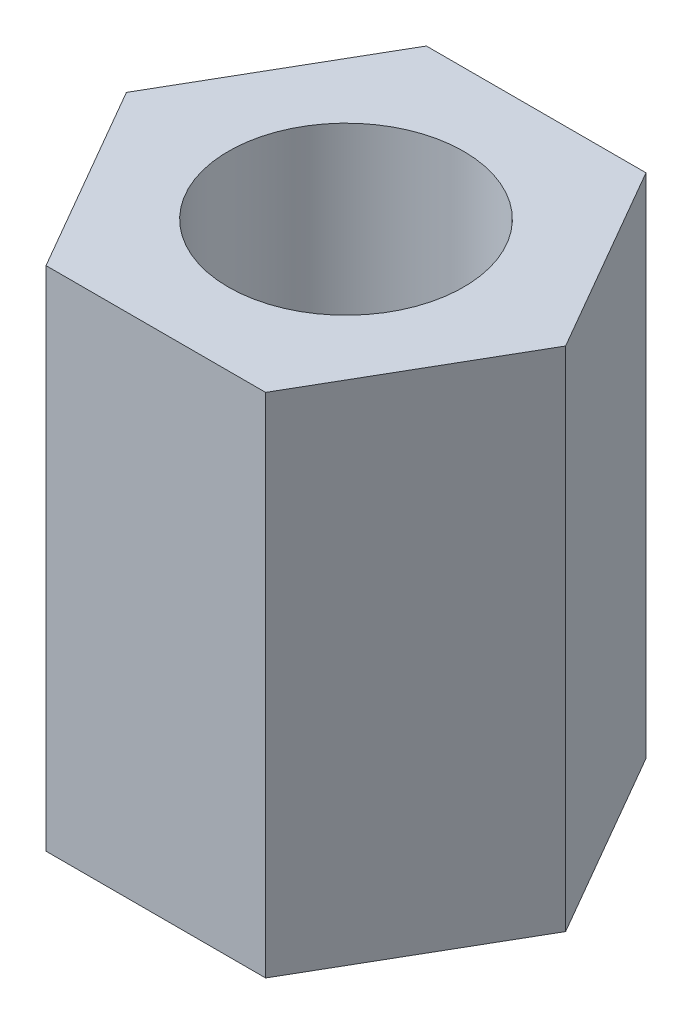
ISO-10303-21;
HEADER;
FILE_DESCRIPTION(('STEP AP214'),'2;1');
FILE_NAME('part.step','',(''),(''),'','','');
FILE_SCHEMA(('AUTOMOTIVE_DESIGN { 1 0 10303 214 1 1 1 1 }'));
ENDSEC;
DATA;
#1=APPLICATION_CONTEXT('core data for automotive mechanical design processes');
#2=APPLICATION_PROTOCOL_DEFINITION('international standard','automotive_design',2000,#1);
#3=PRODUCT_CONTEXT('',#1,'mechanical');
#4=PRODUCT('Part','Part','',(#3));
#5=PRODUCT_RELATED_PRODUCT_CATEGORY('part','',(#4));
#6=PRODUCT_DEFINITION_FORMATION('','',#4);
#7=PRODUCT_DEFINITION_CONTEXT('part definition',#1,'design');
#8=PRODUCT_DEFINITION('design','',#6,#7);
#9=PRODUCT_DEFINITION_SHAPE('','',#8);
#10=(LENGTH_UNIT() NAMED_UNIT(*) SI_UNIT(.MILLI.,.METRE.));
#11=(NAMED_UNIT(*) PLANE_ANGLE_UNIT() SI_UNIT($,.RADIAN.));
#12=(NAMED_UNIT(*) SI_UNIT($,.STERADIAN.) SOLID_ANGLE_UNIT());
#13=UNCERTAINTY_MEASURE_WITH_UNIT(LENGTH_MEASURE(1.E-05),#10,'distance_accuracy_value','');
#14=(GEOMETRIC_REPRESENTATION_CONTEXT(3) GLOBAL_UNCERTAINTY_ASSIGNED_CONTEXT((#13)) GLOBAL_UNIT_ASSIGNED_CONTEXT((#10,
#11,#12)) REPRESENTATION_CONTEXT('',''));
#15=CARTESIAN_POINT('',(0.,0.,0.));
#16=DIRECTION('',(0.,0.,1.));
#17=DIRECTION('',(1.,0.,0.));
#18=AXIS2_PLACEMENT_3D('',#15,#16,#17);
#19=CARTESIAN_POINT('',(0.,6.35,0.));
#20=DIRECTION('',(0.,-1.,0.));
#21=DIRECTION('',(0.,0.,-1.));
#22=AXIS2_PLACEMENT_3D('',#19,#20,#21);
#23=PLANE('',#22);
#24=DIRECTION('',(0.5,0.,0.866025403784439));
#25=VECTOR('',#24,1.);
#26=CARTESIAN_POINT('',(-1.3748153285078,6.35,2.38125));
#27=LINE('',#26,#25);
#28=CARTESIAN_POINT('',(-2.74963065701559,6.35,0.));
#29=VERTEX_POINT('',#28);
#30=CARTESIAN_POINT('',(-1.3748153285078,6.35,2.38125));
#31=VERTEX_POINT('',#30);
#32=EDGE_CURVE('E132',#29,#31,#27,.T.);
#33=ORIENTED_EDGE('',*,*,#32,.T.);
#34=DIRECTION('',(1.,0.,0.));
#35=VECTOR('',#34,1.);
#36=CARTESIAN_POINT('',(1.3748153285078,6.35,2.38125));
#37=LINE('',#36,#35);
#38=CARTESIAN_POINT('',(1.3748153285078,6.35,2.38125));
#39=VERTEX_POINT('',#38);
#40=EDGE_CURVE('E90',#31,#39,#37,.T.);
#41=ORIENTED_EDGE('',*,*,#40,.T.);
#42=DIRECTION('',(0.5,0.,-0.866025403784439));
#43=VECTOR('',#42,1.);
#44=CARTESIAN_POINT('',(2.74963065701559,6.35,0.));
#45=LINE('',#44,#43);
#46=CARTESIAN_POINT('',(2.74963065701559,6.35,0.));
#47=VERTEX_POINT('',#46);
#48=EDGE_CURVE('E103',#39,#47,#45,.T.);
#49=ORIENTED_EDGE('',*,*,#48,.T.);
#50=DIRECTION('',(-0.5,0.,-0.866025403784438));
#51=VECTOR('',#50,1.);
#52=CARTESIAN_POINT('',(1.3748153285078,6.35,-2.38125));
#53=LINE('',#52,#51);
#54=CARTESIAN_POINT('',(1.3748153285078,6.35,-2.38125));
#55=VERTEX_POINT('',#54);
#56=EDGE_CURVE('E97',#47,#55,#53,.T.);
#57=ORIENTED_EDGE('',*,*,#56,.T.);
#58=DIRECTION('',(-1.,0.,0.));
#59=VECTOR('',#58,1.);
#60=CARTESIAN_POINT('',(-1.3748153285078,6.35,-2.38125));
#61=LINE('',#60,#59);
#62=CARTESIAN_POINT('',(-1.3748153285078,6.35,-2.38125));
#63=VERTEX_POINT('',#62);
#64=EDGE_CURVE('E101',#55,#63,#61,.T.);
#65=ORIENTED_EDGE('',*,*,#64,.T.);
#66=DIRECTION('',(-0.5,0.,0.866025403784439));
#67=VECTOR('',#66,1.);
#68=CARTESIAN_POINT('',(-2.74963065701559,6.35,0.));
#69=LINE('',#68,#67);
#70=EDGE_CURVE('E53',#63,#29,#69,.T.);
#71=ORIENTED_EDGE('',*,*,#70,.T.);
#72=EDGE_LOOP('',(#33,#41,#49,#57,#65,#71));
#73=FACE_BOUND('',#72,.T.);
#74=CARTESIAN_POINT('',(0.,6.35,0.));
#75=DIRECTION('',(0.,1.,0.));
#76=DIRECTION('',(0.,0.,1.));
#77=AXIS2_PLACEMENT_3D('',#74,#75,#76);
#78=CIRCLE('',#77,1.4732);
#79=CARTESIAN_POINT('',(0.,6.35,1.4732));
#80=VERTEX_POINT('',#79);
#81=EDGE_CURVE('E125',#80,#80,#78,.T.);
#82=ORIENTED_EDGE('',*,*,#81,.F.);
#83=EDGE_LOOP('',(#82));
#84=FACE_BOUND('',#83,.T.);
#85=ADVANCED_FACE('F36',(#73,#84),#23,.F.);
#86=CARTESIAN_POINT('',(0.,0.,0.));
#87=DIRECTION('',(0.,-1.,0.));
#88=DIRECTION('',(0.,0.,-1.));
#89=AXIS2_PLACEMENT_3D('',#86,#87,#88);
#90=PLANE('',#89);
#91=DIRECTION('',(0.5,0.,0.866025403784439));
#92=VECTOR('',#91,1.);
#93=CARTESIAN_POINT('',(-1.3748153285078,0.,2.38125));
#94=LINE('',#93,#92);
#95=CARTESIAN_POINT('',(-2.74963065701559,0.,0.));
#96=VERTEX_POINT('',#95);
#97=CARTESIAN_POINT('',(-1.3748153285078,0.,2.38125));
#98=VERTEX_POINT('',#97);
#99=EDGE_CURVE('E121',#96,#98,#94,.T.);
#100=ORIENTED_EDGE('',*,*,#99,.F.);
#101=DIRECTION('',(-0.5,0.,0.866025403784439));
#102=VECTOR('',#101,1.);
#103=CARTESIAN_POINT('',(-2.74963065701559,0.,0.));
#104=LINE('',#103,#102);
#105=CARTESIAN_POINT('',(-1.3748153285078,0.,-2.38125));
#106=VERTEX_POINT('',#105);
#107=EDGE_CURVE('E82',#106,#96,#104,.T.);
#108=ORIENTED_EDGE('',*,*,#107,.F.);
#109=DIRECTION('',(-1.,0.,0.));
#110=VECTOR('',#109,1.);
#111=CARTESIAN_POINT('',(-1.3748153285078,0.,-2.38125));
#112=LINE('',#111,#110);
#113=CARTESIAN_POINT('',(1.3748153285078,0.,-2.38125));
#114=VERTEX_POINT('',#113);
#115=EDGE_CURVE('E76',#114,#106,#112,.T.);
#116=ORIENTED_EDGE('',*,*,#115,.F.);
#117=DIRECTION('',(-0.5,0.,-0.866025403784438));
#118=VECTOR('',#117,1.);
#119=CARTESIAN_POINT('',(1.3748153285078,0.,-2.38125));
#120=LINE('',#119,#118);
#121=CARTESIAN_POINT('',(2.74963065701559,0.,0.));
#122=VERTEX_POINT('',#121);
#123=EDGE_CURVE('E111',#122,#114,#120,.T.);
#124=ORIENTED_EDGE('',*,*,#123,.F.);
#125=DIRECTION('',(0.5,0.,-0.866025403784439));
#126=VECTOR('',#125,1.);
#127=CARTESIAN_POINT('',(2.74963065701559,0.,0.));
#128=LINE('',#127,#126);
#129=CARTESIAN_POINT('',(1.3748153285078,0.,2.38125));
#130=VERTEX_POINT('',#129);
#131=EDGE_CURVE('E127',#130,#122,#128,.T.);
#132=ORIENTED_EDGE('',*,*,#131,.F.);
#133=DIRECTION('',(1.,0.,0.));
#134=VECTOR('',#133,1.);
#135=CARTESIAN_POINT('',(1.3748153285078,0.,2.38125));
#136=LINE('',#135,#134);
#137=EDGE_CURVE('E124',#98,#130,#136,.T.);
#138=ORIENTED_EDGE('',*,*,#137,.F.);
#139=EDGE_LOOP('',(#100,#108,#116,#124,#132,#138));
#140=FACE_BOUND('',#139,.T.);
#141=CARTESIAN_POINT('',(0.,0.,0.));
#142=DIRECTION('',(0.,1.,0.));
#143=DIRECTION('',(0.,0.,1.));
#144=AXIS2_PLACEMENT_3D('',#141,#142,#143);
#145=CIRCLE('',#144,1.4732);
#146=CARTESIAN_POINT('',(0.,0.,1.4732));
#147=VERTEX_POINT('',#146);
#148=EDGE_CURVE('E225',#147,#147,#145,.T.);
#149=ORIENTED_EDGE('',*,*,#148,.T.);
#150=EDGE_LOOP('',(#149));
#151=FACE_BOUND('',#150,.T.);
#152=ADVANCED_FACE('F141',(#140,#151),#90,.T.);
#153=CARTESIAN_POINT('',(-1.3748153285078,6.35,2.38125));
#154=DIRECTION('',(0.866025403784439,0.,-0.5));
#155=DIRECTION('',(-0.5,0.,-0.866025403784439));
#156=AXIS2_PLACEMENT_3D('',#153,#154,#155);
#157=PLANE('',#156);
#158=ORIENTED_EDGE('',*,*,#99,.T.);
#159=DIRECTION('',(0.,-1.,0.));
#160=VECTOR('',#159,1.);
#161=CARTESIAN_POINT('',(-1.3748153285078,6.35,2.38125));
#162=LINE('',#161,#160);
#163=EDGE_CURVE('E11',#31,#98,#162,.T.);
#164=ORIENTED_EDGE('',*,*,#163,.F.);
#165=ORIENTED_EDGE('',*,*,#32,.F.);
#166=DIRECTION('',(0.,-1.,0.));
#167=VECTOR('',#166,1.);
#168=CARTESIAN_POINT('',(-2.74963065701559,6.35,0.));
#169=LINE('',#168,#167);
#170=EDGE_CURVE('E117',#29,#96,#169,.T.);
#171=ORIENTED_EDGE('',*,*,#170,.T.);
#172=EDGE_LOOP('',(#158,#164,#165,#171));
#173=FACE_BOUND('',#172,.T.);
#174=ADVANCED_FACE('F38',(#173),#157,.F.);
#175=CARTESIAN_POINT('',(1.3748153285078,6.35,2.38125));
#176=DIRECTION('',(0.,0.,-1.));
#177=DIRECTION('',(-1.,0.,0.));
#178=AXIS2_PLACEMENT_3D('',#175,#176,#177);
#179=PLANE('',#178);
#180=ORIENTED_EDGE('',*,*,#137,.T.);
#181=DIRECTION('',(0.,-1.,0.));
#182=VECTOR('',#181,1.);
#183=CARTESIAN_POINT('',(1.3748153285078,6.35,2.38125));
#184=LINE('',#183,#182);
#185=EDGE_CURVE('E45',#39,#130,#184,.T.);
#186=ORIENTED_EDGE('',*,*,#185,.F.);
#187=ORIENTED_EDGE('',*,*,#40,.F.);
#188=ORIENTED_EDGE('',*,*,#163,.T.);
#189=EDGE_LOOP('',(#180,#186,#187,#188));
#190=FACE_BOUND('',#189,.T.);
#191=ADVANCED_FACE('F166',(#190),#179,.F.);
#192=CARTESIAN_POINT('',(2.74963065701559,6.35,0.));
#193=DIRECTION('',(-0.866025403784439,0.,-0.5));
#194=DIRECTION('',(-0.5,0.,0.866025403784439));
#195=AXIS2_PLACEMENT_3D('',#192,#193,#194);
#196=PLANE('',#195);
#197=ORIENTED_EDGE('',*,*,#131,.T.);
#198=DIRECTION('',(0.,-1.,0.));
#199=VECTOR('',#198,1.);
#200=CARTESIAN_POINT('',(2.74963065701559,6.35,0.));
#201=LINE('',#200,#199);
#202=EDGE_CURVE('E112',#47,#122,#201,.T.);
#203=ORIENTED_EDGE('',*,*,#202,.F.);
#204=ORIENTED_EDGE('',*,*,#48,.F.);
#205=ORIENTED_EDGE('',*,*,#185,.T.);
#206=EDGE_LOOP('',(#197,#203,#204,#205));
#207=FACE_BOUND('',#206,.T.);
#208=ADVANCED_FACE('F138',(#207),#196,.F.);
#209=CARTESIAN_POINT('',(1.3748153285078,6.35,-2.38125));
#210=DIRECTION('',(-0.866025403784438,0.,0.5));
#211=DIRECTION('',(0.5,0.,0.866025403784439));
#212=AXIS2_PLACEMENT_3D('',#209,#210,#211);
#213=PLANE('',#212);
#214=ORIENTED_EDGE('',*,*,#123,.T.);
#215=DIRECTION('',(0.,-1.,0.));
#216=VECTOR('',#215,1.);
#217=CARTESIAN_POINT('',(1.3748153285078,6.35,-2.38125));
#218=LINE('',#217,#216);
#219=EDGE_CURVE('E108',#55,#114,#218,.T.);
#220=ORIENTED_EDGE('',*,*,#219,.F.);
#221=ORIENTED_EDGE('',*,*,#56,.F.);
#222=ORIENTED_EDGE('',*,*,#202,.T.);
#223=EDGE_LOOP('',(#214,#220,#221,#222));
#224=FACE_BOUND('',#223,.T.);
#225=ADVANCED_FACE('F109',(#224),#213,.F.);
#226=CARTESIAN_POINT('',(-1.3748153285078,6.35,-2.38125));
#227=DIRECTION('',(0.,0.,1.));
#228=DIRECTION('',(1.,0.,0.));
#229=AXIS2_PLACEMENT_3D('',#226,#227,#228);
#230=PLANE('',#229);
#231=ORIENTED_EDGE('',*,*,#115,.T.);
#232=DIRECTION('',(0.,-1.,0.));
#233=VECTOR('',#232,1.);
#234=CARTESIAN_POINT('',(-1.3748153285078,6.35,-2.38125));
#235=LINE('',#234,#233);
#236=EDGE_CURVE('E113',#63,#106,#235,.T.);
#237=ORIENTED_EDGE('',*,*,#236,.F.);
#238=ORIENTED_EDGE('',*,*,#64,.F.);
#239=ORIENTED_EDGE('',*,*,#219,.T.);
#240=EDGE_LOOP('',(#231,#237,#238,#239));
#241=FACE_BOUND('',#240,.T.);
#242=ADVANCED_FACE('F115',(#241),#230,.F.);
#243=CARTESIAN_POINT('',(-2.74963065701559,6.35,0.));
#244=DIRECTION('',(0.866025403784439,0.,0.5));
#245=DIRECTION('',(0.5,0.,-0.866025403784439));
#246=AXIS2_PLACEMENT_3D('',#243,#244,#245);
#247=PLANE('',#246);
#248=ORIENTED_EDGE('',*,*,#107,.T.);
#249=ORIENTED_EDGE('',*,*,#170,.F.);
#250=ORIENTED_EDGE('',*,*,#70,.F.);
#251=ORIENTED_EDGE('',*,*,#236,.T.);
#252=EDGE_LOOP('',(#248,#249,#250,#251));
#253=FACE_BOUND('',#252,.T.);
#254=ADVANCED_FACE('F146',(#253),#247,.F.);
#255=CARTESIAN_POINT('',(0.,6.35,0.));
#256=DIRECTION('',(0.,-1.,0.));
#257=DIRECTION('',(0.,0.,-1.));
#258=AXIS2_PLACEMENT_3D('',#255,#256,#257);
#259=CYLINDRICAL_SURFACE('',#258,1.4732);
#260=ORIENTED_EDGE('',*,*,#81,.T.);
#261=EDGE_LOOP('',(#260));
#262=FACE_BOUND('',#261,.T.);
#263=ORIENTED_EDGE('',*,*,#148,.F.);
#264=EDGE_LOOP('',(#263));
#265=FACE_BOUND('',#264,.T.);
#266=ADVANCED_FACE('F148',(#262,#265),#259,.F.);
#267=CLOSED_SHELL('',(#85,#152,#174,#191,#208,#225,#242,#254,#266));
#268=MANIFOLD_SOLID_BREP('B2',#267);
#269=ADVANCED_BREP_SHAPE_REPRESENTATION('',(#18,#268),#14);
#270=SHAPE_DEFINITION_REPRESENTATION(#9,#269);
ENDSEC;
END-ISO-10303-21;
